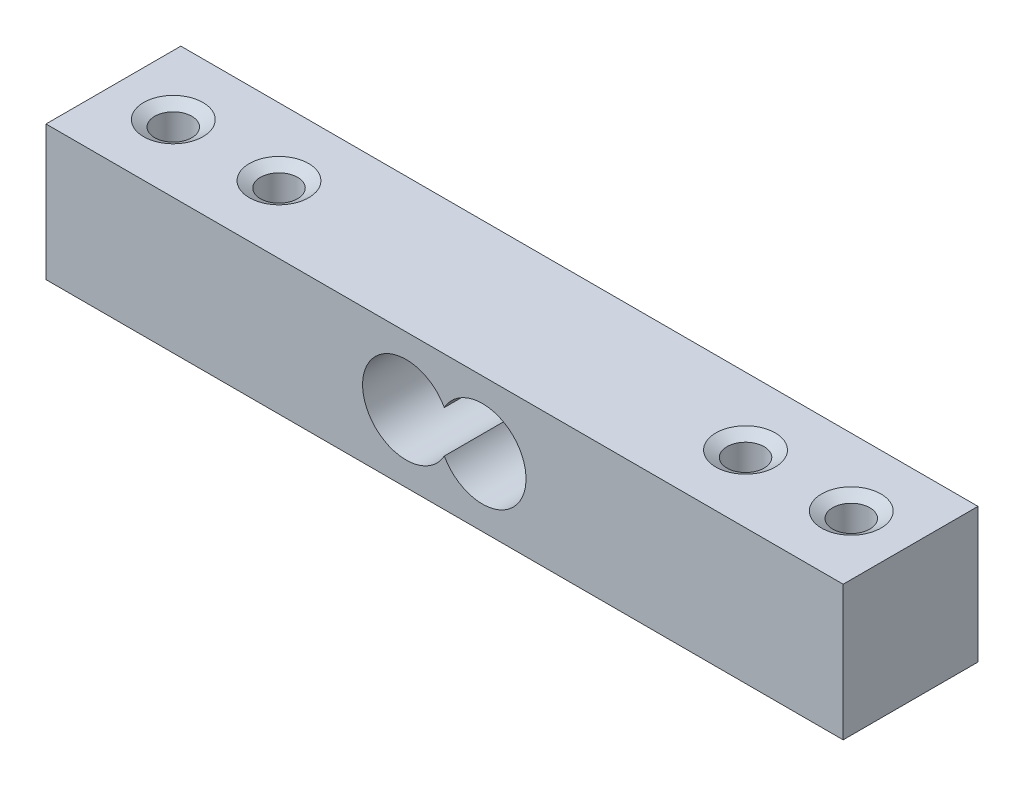
ISO-10303-21;
HEADER;
FILE_DESCRIPTION(('STEP AP214'),'2;1');
FILE_NAME('part.step','',(''),(''),'','','');
FILE_SCHEMA(('AUTOMOTIVE_DESIGN { 1 0 10303 214 1 1 1 1 }'));
ENDSEC;
DATA;
#1=APPLICATION_CONTEXT('core data for automotive mechanical design processes');
#2=APPLICATION_PROTOCOL_DEFINITION('international standard','automotive_design',2000,#1);
#3=PRODUCT_CONTEXT('',#1,'mechanical');
#4=PRODUCT('Part','Part','',(#3));
#5=PRODUCT_RELATED_PRODUCT_CATEGORY('part','',(#4));
#6=PRODUCT_DEFINITION_FORMATION('','',#4);
#7=PRODUCT_DEFINITION_CONTEXT('part definition',#1,'design');
#8=PRODUCT_DEFINITION('design','',#6,#7);
#9=PRODUCT_DEFINITION_SHAPE('','',#8);
#10=(LENGTH_UNIT() NAMED_UNIT(*) SI_UNIT(.MILLI.,.METRE.));
#11=(NAMED_UNIT(*) PLANE_ANGLE_UNIT() SI_UNIT($,.RADIAN.));
#12=(NAMED_UNIT(*) SI_UNIT($,.STERADIAN.) SOLID_ANGLE_UNIT());
#13=UNCERTAINTY_MEASURE_WITH_UNIT(LENGTH_MEASURE(1.E-05),#10,'distance_accuracy_value','');
#14=(GEOMETRIC_REPRESENTATION_CONTEXT(3) GLOBAL_UNCERTAINTY_ASSIGNED_CONTEXT((#13)) GLOBAL_UNIT_ASSIGNED_CONTEXT((#10,
#11,#12)) REPRESENTATION_CONTEXT('',''));
#15=CARTESIAN_POINT('',(0.,0.,0.));
#16=DIRECTION('',(0.,0.,1.));
#17=DIRECTION('',(1.,0.,0.));
#18=AXIS2_PLACEMENT_3D('',#15,#16,#17);
#19=CARTESIAN_POINT('',(5.6388,0.602753681034,6.35));
#20=DIRECTION('',(0.,1.,0.));
#21=DIRECTION('',(-1.,0.,0.));
#22=AXIS2_PLACEMENT_3D('',#19,#20,#21);
#23=CYLINDRICAL_SURFACE('',#22,1.75);
#24=CARTESIAN_POINT('',(5.6388,0.602753681034,6.35));
#25=DIRECTION('',(0.,-1.,0.));
#26=DIRECTION('',(-1.,0.,0.));
#27=AXIS2_PLACEMENT_3D('',#24,#25,#26);
#28=CIRCLE('',#27,1.75);
#29=CARTESIAN_POINT('',(3.8888,0.602753681034,6.35));
#30=VERTEX_POINT('',#29);
#31=EDGE_CURVE('E203',#30,#30,#28,.T.);
#32=ORIENTED_EDGE('',*,*,#31,.T.);
#33=DIRECTION('',(0.,1.,0.));
#34=VECTOR('',#33,1.);
#35=CARTESIAN_POINT('',(3.8888,0.602753681034,6.35));
#36=LINE('',#35,#34);
#37=CARTESIAN_POINT('',(3.8888,12.097246318966,6.35));
#38=VERTEX_POINT('',#37);
#39=EDGE_CURVE('E11',#30,#38,#36,.T.);
#40=ORIENTED_EDGE('',*,*,#39,.T.);
#41=CARTESIAN_POINT('',(5.6388,12.097246318966,6.35));
#42=DIRECTION('',(0.,-1.,0.));
#43=DIRECTION('',(-1.,0.,0.));
#44=AXIS2_PLACEMENT_3D('',#41,#42,#43);
#45=CIRCLE('',#44,1.75);
#46=EDGE_CURVE('E208',#38,#38,#45,.T.);
#47=ORIENTED_EDGE('',*,*,#46,.F.);
#48=ORIENTED_EDGE('',*,*,#39,.F.);
#49=EDGE_LOOP('',(#32,#40,#47,#48));
#50=FACE_BOUND('',#49,.T.);
#51=ADVANCED_FACE('F17',(#50),#23,.F.);
#52=CARTESIAN_POINT('',(15.5956,0.602753681034,6.35));
#53=DIRECTION('',(0.,1.,0.));
#54=DIRECTION('',(-1.,0.,0.));
#55=AXIS2_PLACEMENT_3D('',#52,#53,#54);
#56=CYLINDRICAL_SURFACE('',#55,1.75);
#57=CARTESIAN_POINT('',(15.5956,0.602753681034,6.35));
#58=DIRECTION('',(0.,-1.,0.));
#59=DIRECTION('',(-1.,0.,0.));
#60=AXIS2_PLACEMENT_3D('',#57,#58,#59);
#61=CIRCLE('',#60,1.75);
#62=CARTESIAN_POINT('',(13.8456,0.602753681034,6.35));
#63=VERTEX_POINT('',#62);
#64=EDGE_CURVE('E204',#63,#63,#61,.T.);
#65=ORIENTED_EDGE('',*,*,#64,.T.);
#66=DIRECTION('',(0.,1.,0.));
#67=VECTOR('',#66,1.);
#68=CARTESIAN_POINT('',(13.8456,0.602753681034,6.35));
#69=LINE('',#68,#67);
#70=CARTESIAN_POINT('',(13.8456,12.097246318966,6.35));
#71=VERTEX_POINT('',#70);
#72=EDGE_CURVE('E28',#63,#71,#69,.T.);
#73=ORIENTED_EDGE('',*,*,#72,.T.);
#74=CARTESIAN_POINT('',(15.5956,12.097246318966,6.35));
#75=DIRECTION('',(0.,-1.,0.));
#76=DIRECTION('',(-1.,0.,0.));
#77=AXIS2_PLACEMENT_3D('',#74,#75,#76);
#78=CIRCLE('',#77,1.75);
#79=EDGE_CURVE('E296',#71,#71,#78,.T.);
#80=ORIENTED_EDGE('',*,*,#79,.F.);
#81=ORIENTED_EDGE('',*,*,#72,.F.);
#82=EDGE_LOOP('',(#65,#73,#80,#81));
#83=FACE_BOUND('',#82,.T.);
#84=ADVANCED_FACE('F351',(#83),#56,.F.);
#85=CARTESIAN_POINT('',(59.5376,0.602753681034,6.35));
#86=DIRECTION('',(0.,1.,0.));
#87=DIRECTION('',(-1.,0.,0.));
#88=AXIS2_PLACEMENT_3D('',#85,#86,#87);
#89=CYLINDRICAL_SURFACE('',#88,1.75);
#90=CARTESIAN_POINT('',(59.5376,0.602753681034,6.35));
#91=DIRECTION('',(0.,-1.,0.));
#92=DIRECTION('',(-1.,0.,0.));
#93=AXIS2_PLACEMENT_3D('',#90,#91,#92);
#94=CIRCLE('',#93,1.75);
#95=CARTESIAN_POINT('',(57.7876,0.602753681034,6.35));
#96=VERTEX_POINT('',#95);
#97=EDGE_CURVE('E286',#96,#96,#94,.T.);
#98=ORIENTED_EDGE('',*,*,#97,.T.);
#99=DIRECTION('',(0.,1.,0.));
#100=VECTOR('',#99,1.);
#101=CARTESIAN_POINT('',(57.7876,0.602753681034,6.35));
#102=LINE('',#101,#100);
#103=CARTESIAN_POINT('',(57.7876,12.097246318966,6.35));
#104=VERTEX_POINT('',#103);
#105=EDGE_CURVE('E156',#96,#104,#102,.T.);
#106=ORIENTED_EDGE('',*,*,#105,.T.);
#107=CARTESIAN_POINT('',(59.5376,12.097246318966,6.35));
#108=DIRECTION('',(0.,-1.,0.));
#109=DIRECTION('',(-1.,0.,0.));
#110=AXIS2_PLACEMENT_3D('',#107,#108,#109);
#111=CIRCLE('',#110,1.75);
#112=EDGE_CURVE('E240',#104,#104,#111,.T.);
#113=ORIENTED_EDGE('',*,*,#112,.F.);
#114=ORIENTED_EDGE('',*,*,#105,.F.);
#115=EDGE_LOOP('',(#98,#106,#113,#114));
#116=FACE_BOUND('',#115,.T.);
#117=ADVANCED_FACE('F19',(#116),#89,.F.);
#118=CARTESIAN_POINT('',(69.4944,0.602753681034,6.35));
#119=DIRECTION('',(0.,1.,0.));
#120=DIRECTION('',(-1.,0.,0.));
#121=AXIS2_PLACEMENT_3D('',#118,#119,#120);
#122=CYLINDRICAL_SURFACE('',#121,1.75);
#123=CARTESIAN_POINT('',(69.4944,0.602753681034,6.35));
#124=DIRECTION('',(0.,-1.,0.));
#125=DIRECTION('',(-1.,0.,0.));
#126=AXIS2_PLACEMENT_3D('',#123,#124,#125);
#127=CIRCLE('',#126,1.75);
#128=CARTESIAN_POINT('',(67.7444,0.602753681034,6.35));
#129=VERTEX_POINT('',#128);
#130=EDGE_CURVE('E166',#129,#129,#127,.T.);
#131=ORIENTED_EDGE('',*,*,#130,.T.);
#132=DIRECTION('',(0.,1.,0.));
#133=VECTOR('',#132,1.);
#134=CARTESIAN_POINT('',(67.7444,0.602753681034,6.35));
#135=LINE('',#134,#133);
#136=CARTESIAN_POINT('',(67.7444,12.097246318966,6.35));
#137=VERTEX_POINT('',#136);
#138=EDGE_CURVE('E163',#129,#137,#135,.T.);
#139=ORIENTED_EDGE('',*,*,#138,.T.);
#140=CARTESIAN_POINT('',(69.4944,12.097246318966,6.35));
#141=DIRECTION('',(0.,-1.,0.));
#142=DIRECTION('',(-1.,0.,0.));
#143=AXIS2_PLACEMENT_3D('',#140,#141,#142);
#144=CIRCLE('',#143,1.75);
#145=EDGE_CURVE('E168',#137,#137,#144,.T.);
#146=ORIENTED_EDGE('',*,*,#145,.F.);
#147=ORIENTED_EDGE('',*,*,#138,.F.);
#148=EDGE_LOOP('',(#131,#139,#146,#147));
#149=FACE_BOUND('',#148,.T.);
#150=ADVANCED_FACE('F164',(#149),#122,.F.);
#151=CARTESIAN_POINT('',(33.9217,6.35,12.7));
#152=DIRECTION('',(0.,0.,1.));
#153=DIRECTION('',(1.,0.,0.));
#154=AXIS2_PLACEMENT_3D('',#151,#152,#153);
#155=CYLINDRICAL_SURFACE('',#154,4.1021);
#156=DIRECTION('',(0.,0.,-1.));
#157=VECTOR('',#156,1.);
#158=CARTESIAN_POINT('',(37.5158,4.372711553667,12.7));
#159=LINE('',#158,#157);
#160=CARTESIAN_POINT('',(37.5158,4.372711553667,12.7));
#161=VERTEX_POINT('',#160);
#162=CARTESIAN_POINT('',(37.5158,4.372711553667,0.));
#163=VERTEX_POINT('',#162);
#164=EDGE_CURVE('E171',#161,#163,#159,.T.);
#165=ORIENTED_EDGE('',*,*,#164,.T.);
#166=CARTESIAN_POINT('',(33.9217,6.35,0.));
#167=DIRECTION('',(0.,0.,1.));
#168=DIRECTION('',(1.,0.,0.));
#169=AXIS2_PLACEMENT_3D('',#166,#167,#168);
#170=CIRCLE('',#169,4.1021);
#171=CARTESIAN_POINT('',(37.5158,8.327288446333,0.));
#172=VERTEX_POINT('',#171);
#173=EDGE_CURVE('E268',#172,#163,#170,.T.);
#174=ORIENTED_EDGE('',*,*,#173,.F.);
#175=DIRECTION('',(0.,0.,-1.));
#176=VECTOR('',#175,1.);
#177=CARTESIAN_POINT('',(37.5158,8.327288446333,12.7));
#178=LINE('',#177,#176);
#179=CARTESIAN_POINT('',(37.5158,8.327288446333,12.7));
#180=VERTEX_POINT('',#179);
#181=EDGE_CURVE('E21',#180,#172,#178,.T.);
#182=ORIENTED_EDGE('',*,*,#181,.F.);
#183=CARTESIAN_POINT('',(33.9217,6.35,12.7));
#184=DIRECTION('',(0.,0.,1.));
#185=DIRECTION('',(1.,0.,0.));
#186=AXIS2_PLACEMENT_3D('',#183,#184,#185);
#187=CIRCLE('',#186,4.1021);
#188=EDGE_CURVE('E198',#180,#161,#187,.T.);
#189=ORIENTED_EDGE('',*,*,#188,.T.);
#190=EDGE_LOOP('',(#165,#174,#182,#189));
#191=FACE_BOUND('',#190,.T.);
#192=ADVANCED_FACE('F401',(#191),#155,.F.);
#193=CARTESIAN_POINT('',(41.1099,6.35,12.7));
#194=DIRECTION('',(0.,0.,1.));
#195=DIRECTION('',(1.,0.,0.));
#196=AXIS2_PLACEMENT_3D('',#193,#194,#195);
#197=CYLINDRICAL_SURFACE('',#196,4.1021);
#198=ORIENTED_EDGE('',*,*,#181,.T.);
#199=CARTESIAN_POINT('',(41.1099,6.35,0.));
#200=DIRECTION('',(0.,0.,1.));
#201=DIRECTION('',(1.,0.,0.));
#202=AXIS2_PLACEMENT_3D('',#199,#200,#201);
#203=CIRCLE('',#202,4.1021);
#204=EDGE_CURVE('E180',#163,#172,#203,.T.);
#205=ORIENTED_EDGE('',*,*,#204,.F.);
#206=ORIENTED_EDGE('',*,*,#164,.F.);
#207=CARTESIAN_POINT('',(41.1099,6.35,12.7));
#208=DIRECTION('',(0.,0.,1.));
#209=DIRECTION('',(1.,0.,0.));
#210=AXIS2_PLACEMENT_3D('',#207,#208,#209);
#211=CIRCLE('',#210,4.1021);
#212=EDGE_CURVE('E193',#161,#180,#211,.T.);
#213=ORIENTED_EDGE('',*,*,#212,.T.);
#214=EDGE_LOOP('',(#198,#205,#206,#213));
#215=FACE_BOUND('',#214,.T.);
#216=ADVANCED_FACE('F399',(#215),#197,.F.);
#217=CARTESIAN_POINT('',(5.6388,12.7,6.35));
#218=DIRECTION('',(0.,1.,0.));
#219=DIRECTION('',(-1.,0.,0.));
#220=AXIS2_PLACEMENT_3D('',#217,#218,#219);
#221=CONICAL_SURFACE('',#220,2.794,1.047197551197);
#222=DIRECTION('',(0.866025403784329,-0.50000000000019,0.));
#223=VECTOR('',#222,1.);
#224=CARTESIAN_POINT('',(2.8448,12.7,6.35));
#225=LINE('',#224,#223);
#226=CARTESIAN_POINT('',(2.8448,12.7,6.35));
#227=VERTEX_POINT('',#226);
#228=EDGE_CURVE('E205',#227,#38,#225,.T.);
#229=ORIENTED_EDGE('',*,*,#228,.T.);
#230=ORIENTED_EDGE('',*,*,#46,.T.);
#231=ORIENTED_EDGE('',*,*,#228,.F.);
#232=CARTESIAN_POINT('',(5.6388,12.7,6.35));
#233=DIRECTION('',(0.,-1.,0.));
#234=DIRECTION('',(-1.,0.,0.));
#235=AXIS2_PLACEMENT_3D('',#232,#233,#234);
#236=CIRCLE('',#235,2.794);
#237=EDGE_CURVE('E262',#227,#227,#236,.T.);
#238=ORIENTED_EDGE('',*,*,#237,.F.);
#239=EDGE_LOOP('',(#229,#230,#231,#238));
#240=FACE_BOUND('',#239,.T.);
#241=ADVANCED_FACE('F395',(#240),#221,.F.);
#242=CARTESIAN_POINT('',(69.4944,12.7,6.35));
#243=DIRECTION('',(0.,1.,0.));
#244=DIRECTION('',(-1.,0.,0.));
#245=AXIS2_PLACEMENT_3D('',#242,#243,#244);
#246=CONICAL_SURFACE('',#245,2.794,1.047197551197);
#247=DIRECTION('',(0.866025403784329,-0.50000000000019,0.));
#248=VECTOR('',#247,1.);
#249=CARTESIAN_POINT('',(66.7004,12.7,6.35));
#250=LINE('',#249,#248);
#251=CARTESIAN_POINT('',(66.7004,12.7,6.35));
#252=VERTEX_POINT('',#251);
#253=EDGE_CURVE('E217',#252,#137,#250,.T.);
#254=ORIENTED_EDGE('',*,*,#253,.T.);
#255=ORIENTED_EDGE('',*,*,#145,.T.);
#256=ORIENTED_EDGE('',*,*,#253,.F.);
#257=CARTESIAN_POINT('',(69.4944,12.7,6.35));
#258=DIRECTION('',(0.,-1.,0.));
#259=DIRECTION('',(-1.,0.,0.));
#260=AXIS2_PLACEMENT_3D('',#257,#258,#259);
#261=CIRCLE('',#260,2.794);
#262=EDGE_CURVE('E254',#252,#252,#261,.T.);
#263=ORIENTED_EDGE('',*,*,#262,.F.);
#264=EDGE_LOOP('',(#254,#255,#256,#263));
#265=FACE_BOUND('',#264,.T.);
#266=ADVANCED_FACE('F359',(#265),#246,.F.);
#267=CARTESIAN_POINT('',(59.5376,12.7,6.35));
#268=DIRECTION('',(0.,1.,0.));
#269=DIRECTION('',(-1.,0.,0.));
#270=AXIS2_PLACEMENT_3D('',#267,#268,#269);
#271=CONICAL_SURFACE('',#270,2.794,1.047197551197);
#272=DIRECTION('',(0.866025403784329,-0.50000000000019,0.));
#273=VECTOR('',#272,1.);
#274=CARTESIAN_POINT('',(56.7436,12.7,6.35));
#275=LINE('',#274,#273);
#276=CARTESIAN_POINT('',(56.7436,12.7,6.35));
#277=VERTEX_POINT('',#276);
#278=EDGE_CURVE('E244',#277,#104,#275,.T.);
#279=ORIENTED_EDGE('',*,*,#278,.T.);
#280=ORIENTED_EDGE('',*,*,#112,.T.);
#281=ORIENTED_EDGE('',*,*,#278,.F.);
#282=CARTESIAN_POINT('',(59.5376,12.7,6.35));
#283=DIRECTION('',(0.,-1.,0.));
#284=DIRECTION('',(-1.,0.,0.));
#285=AXIS2_PLACEMENT_3D('',#282,#283,#284);
#286=CIRCLE('',#285,2.794);
#287=EDGE_CURVE('E250',#277,#277,#286,.T.);
#288=ORIENTED_EDGE('',*,*,#287,.F.);
#289=EDGE_LOOP('',(#279,#280,#281,#288));
#290=FACE_BOUND('',#289,.T.);
#291=ADVANCED_FACE('F369',(#290),#271,.F.);
#292=CARTESIAN_POINT('',(15.5956,12.7,6.35));
#293=DIRECTION('',(0.,1.,0.));
#294=DIRECTION('',(-1.,0.,0.));
#295=AXIS2_PLACEMENT_3D('',#292,#293,#294);
#296=CONICAL_SURFACE('',#295,2.794,1.047197551197);
#297=DIRECTION('',(0.866025403784329,-0.50000000000019,0.));
#298=VECTOR('',#297,1.);
#299=CARTESIAN_POINT('',(12.8016,12.7,6.35));
#300=LINE('',#299,#298);
#301=CARTESIAN_POINT('',(12.8016,12.7,6.35));
#302=VERTEX_POINT('',#301);
#303=EDGE_CURVE('E302',#302,#71,#300,.T.);
#304=ORIENTED_EDGE('',*,*,#303,.T.);
#305=ORIENTED_EDGE('',*,*,#79,.T.);
#306=ORIENTED_EDGE('',*,*,#303,.F.);
#307=CARTESIAN_POINT('',(15.5956,12.7,6.35));
#308=DIRECTION('',(0.,-1.,0.));
#309=DIRECTION('',(-1.,0.,0.));
#310=AXIS2_PLACEMENT_3D('',#307,#308,#309);
#311=CIRCLE('',#310,2.794);
#312=EDGE_CURVE('E255',#302,#302,#311,.T.);
#313=ORIENTED_EDGE('',*,*,#312,.F.);
#314=EDGE_LOOP('',(#304,#305,#306,#313));
#315=FACE_BOUND('',#314,.T.);
#316=ADVANCED_FACE('F371',(#315),#296,.F.);
#317=CARTESIAN_POINT('',(5.6388,0.,6.35));
#318=DIRECTION('',(0.,-1.,0.));
#319=DIRECTION('',(-1.,0.,0.));
#320=AXIS2_PLACEMENT_3D('',#317,#318,#319);
#321=CONICAL_SURFACE('',#320,2.794,1.047197551197);
#322=CARTESIAN_POINT('',(5.6388,0.,6.35));
#323=DIRECTION('',(0.,-1.,0.));
#324=DIRECTION('',(-1.,0.,0.));
#325=AXIS2_PLACEMENT_3D('',#322,#323,#324);
#326=CIRCLE('',#325,2.794);
#327=CARTESIAN_POINT('',(2.8448,0.,6.35));
#328=VERTEX_POINT('',#327);
#329=EDGE_CURVE('E245',#328,#328,#326,.T.);
#330=ORIENTED_EDGE('',*,*,#329,.T.);
#331=DIRECTION('',(0.866025403784329,0.50000000000019,0.));
#332=VECTOR('',#331,1.);
#333=CARTESIAN_POINT('',(2.8448,0.,6.35));
#334=LINE('',#333,#332);
#335=EDGE_CURVE('E199',#328,#30,#334,.T.);
#336=ORIENTED_EDGE('',*,*,#335,.T.);
#337=ORIENTED_EDGE('',*,*,#31,.F.);
#338=ORIENTED_EDGE('',*,*,#335,.F.);
#339=EDGE_LOOP('',(#330,#336,#337,#338));
#340=FACE_BOUND('',#339,.T.);
#341=ADVANCED_FACE('F364',(#340),#321,.F.);
#342=CARTESIAN_POINT('',(15.5956,0.,6.35));
#343=DIRECTION('',(0.,-1.,0.));
#344=DIRECTION('',(-1.,0.,0.));
#345=AXIS2_PLACEMENT_3D('',#342,#343,#344);
#346=CONICAL_SURFACE('',#345,2.794,1.047197551197);
#347=CARTESIAN_POINT('',(15.5956,0.,6.35));
#348=DIRECTION('',(0.,-1.,0.));
#349=DIRECTION('',(-1.,0.,0.));
#350=AXIS2_PLACEMENT_3D('',#347,#348,#349);
#351=CIRCLE('',#350,2.794);
#352=CARTESIAN_POINT('',(12.8016,0.,6.35));
#353=VERTEX_POINT('',#352);
#354=EDGE_CURVE('E187',#353,#353,#351,.T.);
#355=ORIENTED_EDGE('',*,*,#354,.T.);
#356=DIRECTION('',(0.866025403784329,0.50000000000019,0.));
#357=VECTOR('',#356,1.);
#358=CARTESIAN_POINT('',(12.8016,0.,6.35));
#359=LINE('',#358,#357);
#360=EDGE_CURVE('E289',#353,#63,#359,.T.);
#361=ORIENTED_EDGE('',*,*,#360,.T.);
#362=ORIENTED_EDGE('',*,*,#64,.F.);
#363=ORIENTED_EDGE('',*,*,#360,.F.);
#364=EDGE_LOOP('',(#355,#361,#362,#363));
#365=FACE_BOUND('',#364,.T.);
#366=ADVANCED_FACE('F361',(#365),#346,.F.);
#367=CARTESIAN_POINT('',(59.5376,0.,6.35));
#368=DIRECTION('',(0.,-1.,0.));
#369=DIRECTION('',(-1.,0.,0.));
#370=AXIS2_PLACEMENT_3D('',#367,#368,#369);
#371=CONICAL_SURFACE('',#370,2.794,1.047197551197);
#372=CARTESIAN_POINT('',(59.5376,0.,6.35));
#373=DIRECTION('',(0.,-1.,0.));
#374=DIRECTION('',(-1.,0.,0.));
#375=AXIS2_PLACEMENT_3D('',#372,#373,#374);
#376=CIRCLE('',#375,2.794);
#377=CARTESIAN_POINT('',(56.7436,0.,6.35));
#378=VERTEX_POINT('',#377);
#379=EDGE_CURVE('E183',#378,#378,#376,.T.);
#380=ORIENTED_EDGE('',*,*,#379,.T.);
#381=DIRECTION('',(0.866025403784329,0.50000000000019,0.));
#382=VECTOR('',#381,1.);
#383=CARTESIAN_POINT('',(56.7436,0.,6.35));
#384=LINE('',#383,#382);
#385=EDGE_CURVE('E274',#378,#96,#384,.T.);
#386=ORIENTED_EDGE('',*,*,#385,.T.);
#387=ORIENTED_EDGE('',*,*,#97,.F.);
#388=ORIENTED_EDGE('',*,*,#385,.F.);
#389=EDGE_LOOP('',(#380,#386,#387,#388));
#390=FACE_BOUND('',#389,.T.);
#391=ADVANCED_FACE('F347',(#390),#371,.F.);
#392=CARTESIAN_POINT('',(69.4944,0.,6.35));
#393=DIRECTION('',(0.,-1.,0.));
#394=DIRECTION('',(-1.,0.,0.));
#395=AXIS2_PLACEMENT_3D('',#392,#393,#394);
#396=CONICAL_SURFACE('',#395,2.794,1.047197551197);
#397=CARTESIAN_POINT('',(69.4944,0.,6.35));
#398=DIRECTION('',(0.,-1.,0.));
#399=DIRECTION('',(-1.,0.,0.));
#400=AXIS2_PLACEMENT_3D('',#397,#398,#399);
#401=CIRCLE('',#400,2.794);
#402=CARTESIAN_POINT('',(66.7004,0.,6.35));
#403=VERTEX_POINT('',#402);
#404=EDGE_CURVE('E188',#403,#403,#401,.T.);
#405=ORIENTED_EDGE('',*,*,#404,.T.);
#406=DIRECTION('',(0.866025403784329,0.50000000000019,0.));
#407=VECTOR('',#406,1.);
#408=CARTESIAN_POINT('',(66.7004,0.,6.35));
#409=LINE('',#408,#407);
#410=EDGE_CURVE('E197',#403,#129,#409,.T.);
#411=ORIENTED_EDGE('',*,*,#410,.T.);
#412=ORIENTED_EDGE('',*,*,#130,.F.);
#413=ORIENTED_EDGE('',*,*,#410,.F.);
#414=EDGE_LOOP('',(#405,#411,#412,#413));
#415=FACE_BOUND('',#414,.T.);
#416=ADVANCED_FACE('F338',(#415),#396,.F.);
#417=CARTESIAN_POINT('',(75.0824,12.7,0.));
#418=DIRECTION('',(1.,0.,0.));
#419=DIRECTION('',(0.,1.,0.));
#420=AXIS2_PLACEMENT_3D('',#417,#418,#419);
#421=PLANE('',#420);
#422=DIRECTION('',(0.,0.,1.));
#423=VECTOR('',#422,1.);
#424=CARTESIAN_POINT('',(75.0824,12.7,0.));
#425=LINE('',#424,#423);
#426=CARTESIAN_POINT('',(75.0824,12.7,0.));
#427=VERTEX_POINT('',#426);
#428=CARTESIAN_POINT('',(75.0824,12.7,12.7));
#429=VERTEX_POINT('',#428);
#430=EDGE_CURVE('E259',#427,#429,#425,.T.);
#431=ORIENTED_EDGE('',*,*,#430,.T.);
#432=DIRECTION('',(0.,-1.,0.));
#433=VECTOR('',#432,1.);
#434=CARTESIAN_POINT('',(75.0824,12.7,12.7));
#435=LINE('',#434,#433);
#436=CARTESIAN_POINT('',(75.0824,0.,12.7));
#437=VERTEX_POINT('',#436);
#438=EDGE_CURVE('E82',#429,#437,#435,.T.);
#439=ORIENTED_EDGE('',*,*,#438,.T.);
#440=DIRECTION('',(0.,0.,1.));
#441=VECTOR('',#440,1.);
#442=CARTESIAN_POINT('',(75.0824,0.,0.));
#443=LINE('',#442,#441);
#444=CARTESIAN_POINT('',(75.0824,0.,0.));
#445=VERTEX_POINT('',#444);
#446=EDGE_CURVE('E220',#445,#437,#443,.T.);
#447=ORIENTED_EDGE('',*,*,#446,.F.);
#448=DIRECTION('',(0.,-1.,0.));
#449=VECTOR('',#448,1.);
#450=CARTESIAN_POINT('',(75.0824,12.7,0.));
#451=LINE('',#450,#449);
#452=EDGE_CURVE('E65',#427,#445,#451,.T.);
#453=ORIENTED_EDGE('',*,*,#452,.F.);
#454=EDGE_LOOP('',(#431,#439,#447,#453));
#455=FACE_BOUND('',#454,.T.);
#456=ADVANCED_FACE('F336',(#455),#421,.T.);
#457=CARTESIAN_POINT('',(37.5412,6.35,12.7));
#458=DIRECTION('',(0.,0.,-1.));
#459=DIRECTION('',(0.,-1.,0.));
#460=AXIS2_PLACEMENT_3D('',#457,#458,#459);
#461=PLANE('',#460);
#462=ORIENTED_EDGE('',*,*,#188,.F.);
#463=ORIENTED_EDGE('',*,*,#212,.F.);
#464=EDGE_LOOP('',(#462,#463));
#465=FACE_BOUND('',#464,.T.);
#466=DIRECTION('',(-1.,0.,0.));
#467=VECTOR('',#466,1.);
#468=CARTESIAN_POINT('',(75.0824,0.,12.7));
#469=LINE('',#468,#467);
#470=CARTESIAN_POINT('',(0.,0.,12.7));
#471=VERTEX_POINT('',#470);
#472=EDGE_CURVE('E192',#437,#471,#469,.T.);
#473=ORIENTED_EDGE('',*,*,#472,.F.);
#474=ORIENTED_EDGE('',*,*,#438,.F.);
#475=DIRECTION('',(1.,0.,0.));
#476=VECTOR('',#475,1.);
#477=CARTESIAN_POINT('',(0.,12.7,12.7));
#478=LINE('',#477,#476);
#479=CARTESIAN_POINT('',(0.,12.7,12.7));
#480=VERTEX_POINT('',#479);
#481=EDGE_CURVE('E248',#480,#429,#478,.T.);
#482=ORIENTED_EDGE('',*,*,#481,.F.);
#483=DIRECTION('',(0.,1.,0.));
#484=VECTOR('',#483,1.);
#485=CARTESIAN_POINT('',(0.,0.,12.7));
#486=LINE('',#485,#484);
#487=EDGE_CURVE('E215',#471,#480,#486,.T.);
#488=ORIENTED_EDGE('',*,*,#487,.F.);
#489=EDGE_LOOP('',(#473,#474,#482,#488));
#490=FACE_BOUND('',#489,.T.);
#491=ADVANCED_FACE('F330',(#465,#490),#461,.F.);
#492=CARTESIAN_POINT('',(37.5412,6.35,0.));
#493=DIRECTION('',(0.,0.,-1.));
#494=DIRECTION('',(0.,-1.,0.));
#495=AXIS2_PLACEMENT_3D('',#492,#493,#494);
#496=PLANE('',#495);
#497=ORIENTED_EDGE('',*,*,#204,.T.);
#498=ORIENTED_EDGE('',*,*,#173,.T.);
#499=EDGE_LOOP('',(#497,#498));
#500=FACE_BOUND('',#499,.T.);
#501=DIRECTION('',(0.,1.,0.));
#502=VECTOR('',#501,1.);
#503=CARTESIAN_POINT('',(0.,0.,0.));
#504=LINE('',#503,#502);
#505=CARTESIAN_POINT('',(0.,0.,0.));
#506=VERTEX_POINT('',#505);
#507=CARTESIAN_POINT('',(0.,12.7,0.));
#508=VERTEX_POINT('',#507);
#509=EDGE_CURVE('E214',#506,#508,#504,.T.);
#510=ORIENTED_EDGE('',*,*,#509,.T.);
#511=DIRECTION('',(1.,0.,0.));
#512=VECTOR('',#511,1.);
#513=CARTESIAN_POINT('',(0.,12.7,0.));
#514=LINE('',#513,#512);
#515=EDGE_CURVE('E256',#508,#427,#514,.T.);
#516=ORIENTED_EDGE('',*,*,#515,.T.);
#517=ORIENTED_EDGE('',*,*,#452,.T.);
#518=DIRECTION('',(-1.,0.,0.));
#519=VECTOR('',#518,1.);
#520=CARTESIAN_POINT('',(75.0824,0.,0.));
#521=LINE('',#520,#519);
#522=EDGE_CURVE('E189',#445,#506,#521,.T.);
#523=ORIENTED_EDGE('',*,*,#522,.T.);
#524=EDGE_LOOP('',(#510,#516,#517,#523));
#525=FACE_BOUND('',#524,.T.);
#526=ADVANCED_FACE('F334',(#500,#525),#496,.T.);
#527=CARTESIAN_POINT('',(0.,12.7,0.));
#528=DIRECTION('',(0.,1.,0.));
#529=DIRECTION('',(1.,0.,0.));
#530=AXIS2_PLACEMENT_3D('',#527,#528,#529);
#531=PLANE('',#530);
#532=ORIENTED_EDGE('',*,*,#237,.T.);
#533=EDGE_LOOP('',(#532));
#534=FACE_BOUND('',#533,.T.);
#535=ORIENTED_EDGE('',*,*,#262,.T.);
#536=EDGE_LOOP('',(#535));
#537=FACE_BOUND('',#536,.T.);
#538=ORIENTED_EDGE('',*,*,#287,.T.);
#539=EDGE_LOOP('',(#538));
#540=FACE_BOUND('',#539,.T.);
#541=ORIENTED_EDGE('',*,*,#312,.T.);
#542=EDGE_LOOP('',(#541));
#543=FACE_BOUND('',#542,.T.);
#544=DIRECTION('',(0.,0.,1.));
#545=VECTOR('',#544,1.);
#546=CARTESIAN_POINT('',(0.,12.7,0.));
#547=LINE('',#546,#545);
#548=EDGE_CURVE('E210',#508,#480,#547,.T.);
#549=ORIENTED_EDGE('',*,*,#548,.T.);
#550=ORIENTED_EDGE('',*,*,#481,.T.);
#551=ORIENTED_EDGE('',*,*,#430,.F.);
#552=ORIENTED_EDGE('',*,*,#515,.F.);
#553=EDGE_LOOP('',(#549,#550,#551,#552));
#554=FACE_BOUND('',#553,.T.);
#555=ADVANCED_FACE('F333',(#534,#537,#540,#543,#554),#531,.T.);
#556=CARTESIAN_POINT('',(75.0824,0.,0.));
#557=DIRECTION('',(0.,-1.,0.));
#558=DIRECTION('',(0.,0.,-1.));
#559=AXIS2_PLACEMENT_3D('',#556,#557,#558);
#560=PLANE('',#559);
#561=ORIENTED_EDGE('',*,*,#329,.F.);
#562=EDGE_LOOP('',(#561));
#563=FACE_BOUND('',#562,.T.);
#564=ORIENTED_EDGE('',*,*,#354,.F.);
#565=EDGE_LOOP('',(#564));
#566=FACE_BOUND('',#565,.T.);
#567=ORIENTED_EDGE('',*,*,#379,.F.);
#568=EDGE_LOOP('',(#567));
#569=FACE_BOUND('',#568,.T.);
#570=ORIENTED_EDGE('',*,*,#404,.F.);
#571=EDGE_LOOP('',(#570));
#572=FACE_BOUND('',#571,.T.);
#573=ORIENTED_EDGE('',*,*,#446,.T.);
#574=ORIENTED_EDGE('',*,*,#472,.T.);
#575=DIRECTION('',(0.,0.,1.));
#576=VECTOR('',#575,1.);
#577=CARTESIAN_POINT('',(0.,0.,0.));
#578=LINE('',#577,#576);
#579=EDGE_CURVE('E236',#506,#471,#578,.T.);
#580=ORIENTED_EDGE('',*,*,#579,.F.);
#581=ORIENTED_EDGE('',*,*,#522,.F.);
#582=EDGE_LOOP('',(#573,#574,#580,#581));
#583=FACE_BOUND('',#582,.T.);
#584=ADVANCED_FACE('F335',(#563,#566,#569,#572,#583),#560,.T.);
#585=CARTESIAN_POINT('',(0.,0.,0.));
#586=DIRECTION('',(-1.,0.,0.));
#587=DIRECTION('',(0.,0.,1.));
#588=AXIS2_PLACEMENT_3D('',#585,#586,#587);
#589=PLANE('',#588);
#590=ORIENTED_EDGE('',*,*,#579,.T.);
#591=ORIENTED_EDGE('',*,*,#487,.T.);
#592=ORIENTED_EDGE('',*,*,#548,.F.);
#593=ORIENTED_EDGE('',*,*,#509,.F.);
#594=EDGE_LOOP('',(#590,#591,#592,#593));
#595=FACE_BOUND('',#594,.T.);
#596=ADVANCED_FACE('F326',(#595),#589,.T.);
#597=CLOSED_SHELL('',(#51,#84,#117,#150,#192,#216,#241,#266,#291,#316,#341,#366,#391,#416,#456,
#491,#526,#555,#584,#596));
#598=MANIFOLD_SOLID_BREP('B1',#597);
#599=ADVANCED_BREP_SHAPE_REPRESENTATION('',(#18,#598),#14);
#600=SHAPE_DEFINITION_REPRESENTATION(#9,#599);
ENDSEC;
END-ISO-10303-21;
